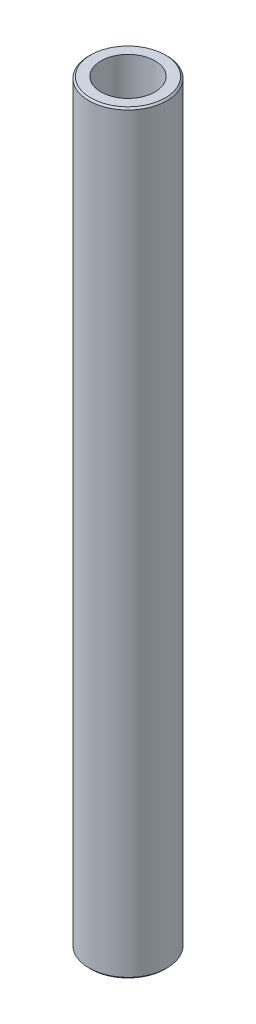
ISO-10303-21;
HEADER;
FILE_DESCRIPTION(('STEP AP214'),'2;1');
FILE_NAME('part.step','',(''),(''),'','','');
FILE_SCHEMA(('AUTOMOTIVE_DESIGN { 1 0 10303 214 1 1 1 1 }'));
ENDSEC;
DATA;
#1=APPLICATION_CONTEXT('core data for automotive mechanical design processes');
#2=APPLICATION_PROTOCOL_DEFINITION('international standard','automotive_design',2000,#1);
#3=PRODUCT_CONTEXT('',#1,'mechanical');
#4=PRODUCT('Part','Part','',(#3));
#5=PRODUCT_RELATED_PRODUCT_CATEGORY('part','',(#4));
#6=PRODUCT_DEFINITION_FORMATION('','',#4);
#7=PRODUCT_DEFINITION_CONTEXT('part definition',#1,'design');
#8=PRODUCT_DEFINITION('design','',#6,#7);
#9=PRODUCT_DEFINITION_SHAPE('','',#8);
#10=(LENGTH_UNIT() NAMED_UNIT(*) SI_UNIT(.MILLI.,.METRE.));
#11=(NAMED_UNIT(*) PLANE_ANGLE_UNIT() SI_UNIT($,.RADIAN.));
#12=(NAMED_UNIT(*) SI_UNIT($,.STERADIAN.) SOLID_ANGLE_UNIT());
#13=UNCERTAINTY_MEASURE_WITH_UNIT(LENGTH_MEASURE(1.E-05),#10,'distance_accuracy_value','');
#14=(GEOMETRIC_REPRESENTATION_CONTEXT(3) GLOBAL_UNCERTAINTY_ASSIGNED_CONTEXT((#13)) GLOBAL_UNIT_ASSIGNED_CONTEXT((#10,
#11,#12)) REPRESENTATION_CONTEXT('',''));
#15=CARTESIAN_POINT('',(0.,0.,0.));
#16=DIRECTION('',(0.,0.,1.));
#17=DIRECTION('',(1.,0.,0.));
#18=AXIS2_PLACEMENT_3D('',#15,#16,#17);
#19=CARTESIAN_POINT('',(0.,193.69387926994,0.));
#20=DIRECTION('',(0.,-1.,0.));
#21=DIRECTION('',(0.,0.,-1.));
#22=AXIS2_PLACEMENT_3D('',#19,#20,#21);
#23=CYLINDRICAL_SURFACE('',#22,10.);
#24=CARTESIAN_POINT('',(0.,193.280216919593,0.));
#25=DIRECTION('',(0.,1.,0.));
#26=DIRECTION('',(0.,0.,1.));
#27=AXIS2_PLACEMENT_3D('',#24,#25,#26);
#28=CIRCLE('',#27,10.);
#29=CARTESIAN_POINT('',(0.,193.280216919593,10.));
#30=VERTEX_POINT('',#29);
#31=EDGE_CURVE('E50',#30,#30,#28,.F.);
#32=ORIENTED_EDGE('',*,*,#31,.T.);
#33=EDGE_LOOP('',(#32));
#34=FACE_BOUND('',#33,.T.);
#35=CARTESIAN_POINT('',(0.,0.437176570740494,0.));
#36=DIRECTION('',(0.,1.,0.));
#37=DIRECTION('',(0.,0.,1.));
#38=AXIS2_PLACEMENT_3D('',#35,#36,#37);
#39=CIRCLE('',#38,10.);
#40=CARTESIAN_POINT('',(0.,0.437176570740494,10.));
#41=VERTEX_POINT('',#40);
#42=EDGE_CURVE('E51',#41,#41,#39,.T.);
#43=ORIENTED_EDGE('',*,*,#42,.T.);
#44=EDGE_LOOP('',(#43));
#45=FACE_BOUND('',#44,.T.);
#46=ADVANCED_FACE('F39',(#34,#45),#23,.T.);
#47=CARTESIAN_POINT('',(0.,193.69387926994,0.));
#48=DIRECTION('',(0.,1.,0.));
#49=DIRECTION('',(0.,0.,1.));
#50=AXIS2_PLACEMENT_3D('',#47,#48,#49);
#51=PLANE('',#50);
#52=CARTESIAN_POINT('',(0.,193.69387926994,0.));
#53=DIRECTION('',(0.,1.,0.));
#54=DIRECTION('',(0.,0.,1.));
#55=AXIS2_PLACEMENT_3D('',#52,#53,#54);
#56=CIRCLE('',#55,9.56282342925951);
#57=CARTESIAN_POINT('',(0.,193.69387926994,9.56282342925951));
#58=VERTEX_POINT('',#57);
#59=EDGE_CURVE('E54',#58,#58,#56,.T.);
#60=ORIENTED_EDGE('',*,*,#59,.T.);
#61=EDGE_LOOP('',(#60));
#62=FACE_BOUND('',#61,.T.);
#63=CARTESIAN_POINT('',(0.,193.69387926994,0.));
#64=DIRECTION('',(0.,1.,0.));
#65=DIRECTION('',(0.,0.,1.));
#66=AXIS2_PLACEMENT_3D('',#63,#64,#65);
#67=CIRCLE('',#66,6.93409671363473);
#68=CARTESIAN_POINT('',(0.,193.69387926994,6.93409671363473));
#69=VERTEX_POINT('',#68);
#70=EDGE_CURVE('E58',#69,#69,#67,.T.);
#71=ORIENTED_EDGE('',*,*,#70,.F.);
#72=EDGE_LOOP('',(#71));
#73=FACE_BOUND('',#72,.T.);
#74=ADVANCED_FACE('F69',(#62,#73),#51,.T.);
#75=CARTESIAN_POINT('',(0.,0.,0.));
#76=DIRECTION('',(0.,1.,0.));
#77=DIRECTION('',(0.,0.,1.));
#78=AXIS2_PLACEMENT_3D('',#75,#76,#77);
#79=PLANE('',#78);
#80=CARTESIAN_POINT('',(0.,0.,0.));
#81=DIRECTION('',(0.,1.,0.));
#82=DIRECTION('',(0.,0.,1.));
#83=AXIS2_PLACEMENT_3D('',#80,#81,#82);
#84=CIRCLE('',#83,9.58633764965312);
#85=CARTESIAN_POINT('',(0.,0.,9.58633764965312));
#86=VERTEX_POINT('',#85);
#87=EDGE_CURVE('E10',#86,#86,#84,.F.);
#88=ORIENTED_EDGE('',*,*,#87,.T.);
#89=EDGE_LOOP('',(#88));
#90=FACE_BOUND('',#89,.T.);
#91=CARTESIAN_POINT('',(0.,0.,0.));
#92=DIRECTION('',(0.,1.,0.));
#93=DIRECTION('',(0.,0.,1.));
#94=AXIS2_PLACEMENT_3D('',#91,#92,#93);
#95=CIRCLE('',#94,6.93409671363473);
#96=CARTESIAN_POINT('',(0.,0.,6.93409671363473));
#97=VERTEX_POINT('',#96);
#98=EDGE_CURVE('E63',#97,#97,#95,.T.);
#99=ORIENTED_EDGE('',*,*,#98,.T.);
#100=EDGE_LOOP('',(#99));
#101=FACE_BOUND('',#100,.T.);
#102=ADVANCED_FACE('F75',(#90,#101),#79,.F.);
#103=CARTESIAN_POINT('',(0.,193.69387926994,0.));
#104=DIRECTION('',(0.,-1.,0.));
#105=DIRECTION('',(0.,0.,-1.));
#106=AXIS2_PLACEMENT_3D('',#103,#104,#105);
#107=CYLINDRICAL_SURFACE('',#106,6.93409671363473);
#108=ORIENTED_EDGE('',*,*,#70,.T.);
#109=EDGE_LOOP('',(#108));
#110=FACE_BOUND('',#109,.T.);
#111=ORIENTED_EDGE('',*,*,#98,.F.);
#112=EDGE_LOOP('',(#111));
#113=FACE_BOUND('',#112,.T.);
#114=ADVANCED_FACE('F70',(#110,#113),#107,.F.);
#115=CARTESIAN_POINT('',(0.,193.69387926994,0.));
#116=DIRECTION('',(0.,-1.,0.));
#117=DIRECTION('',(0.,0.,-1.));
#118=AXIS2_PLACEMENT_3D('',#115,#116,#117);
#119=CONICAL_SURFACE('',#118,9.56282342925951,0.813027642978254);
#120=ORIENTED_EDGE('',*,*,#31,.F.);
#121=EDGE_LOOP('',(#120));
#122=FACE_BOUND('',#121,.T.);
#123=ORIENTED_EDGE('',*,*,#59,.F.);
#124=EDGE_LOOP('',(#123));
#125=FACE_BOUND('',#124,.T.);
#126=ADVANCED_FACE('F81',(#122,#125),#119,.T.);
#127=CARTESIAN_POINT('',(0.,0.437176570740494,0.));
#128=DIRECTION('',(0.,1.,0.));
#129=DIRECTION('',(0.,0.,1.));
#130=AXIS2_PLACEMENT_3D('',#127,#128,#129);
#131=CONICAL_SURFACE('',#130,10.,0.757768683816639);
#132=ORIENTED_EDGE('',*,*,#87,.F.);
#133=EDGE_LOOP('',(#132));
#134=FACE_BOUND('',#133,.T.);
#135=ORIENTED_EDGE('',*,*,#42,.F.);
#136=EDGE_LOOP('',(#135));
#137=FACE_BOUND('',#136,.T.);
#138=ADVANCED_FACE('F45',(#134,#137),#131,.T.);
#139=CLOSED_SHELL('',(#46,#74,#102,#114,#126,#138));
#140=MANIFOLD_SOLID_BREP('B2',#139);
#141=ADVANCED_BREP_SHAPE_REPRESENTATION('',(#18,#140),#14);
#142=SHAPE_DEFINITION_REPRESENTATION(#9,#141);
ENDSEC;
END-ISO-10303-21;
